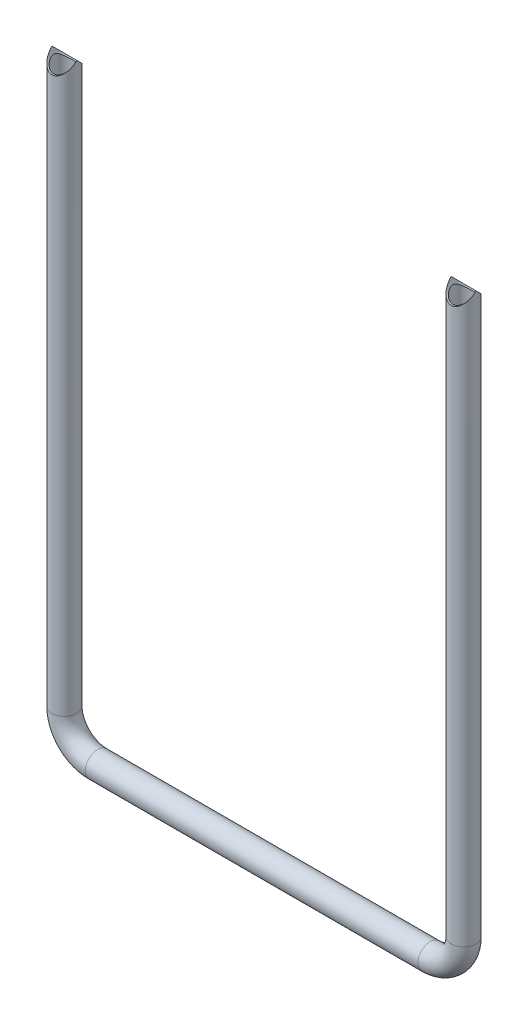
ISO-10303-21;
HEADER;
FILE_DESCRIPTION(('STEP AP214'),'2;1');
FILE_NAME('part.step','',(''),(''),'','','');
FILE_SCHEMA(('AUTOMOTIVE_DESIGN { 1 0 10303 214 1 1 1 1 }'));
ENDSEC;
DATA;
#1=APPLICATION_CONTEXT('core data for automotive mechanical design processes');
#2=APPLICATION_PROTOCOL_DEFINITION('international standard','automotive_design',2000,#1);
#3=PRODUCT_CONTEXT('',#1,'mechanical');
#4=PRODUCT('Part','Part','',(#3));
#5=PRODUCT_RELATED_PRODUCT_CATEGORY('part','',(#4));
#6=PRODUCT_DEFINITION_FORMATION('','',#4);
#7=PRODUCT_DEFINITION_CONTEXT('part definition',#1,'design');
#8=PRODUCT_DEFINITION('design','',#6,#7);
#9=PRODUCT_DEFINITION_SHAPE('','',#8);
#10=(LENGTH_UNIT() NAMED_UNIT(*) SI_UNIT(.MILLI.,.METRE.));
#11=(NAMED_UNIT(*) PLANE_ANGLE_UNIT() SI_UNIT($,.RADIAN.));
#12=(NAMED_UNIT(*) SI_UNIT($,.STERADIAN.) SOLID_ANGLE_UNIT());
#13=UNCERTAINTY_MEASURE_WITH_UNIT(LENGTH_MEASURE(1.E-05),#10,'distance_accuracy_value','');
#14=(GEOMETRIC_REPRESENTATION_CONTEXT(3) GLOBAL_UNCERTAINTY_ASSIGNED_CONTEXT((#13)) GLOBAL_UNIT_ASSIGNED_CONTEXT((#10,
#11,#12)) REPRESENTATION_CONTEXT('',''));
#15=CARTESIAN_POINT('',(0.,0.,0.));
#16=DIRECTION('',(0.,0.,1.));
#17=DIRECTION('',(1.,0.,0.));
#18=AXIS2_PLACEMENT_3D('',#15,#16,#17);
#19=CARTESIAN_POINT('',(-152.4,228.6,0.));
#20=DIRECTION('',(0.,-1.,0.));
#21=DIRECTION('',(0.,0.,-1.));
#22=AXIS2_PLACEMENT_3D('',#19,#20,#21);
#23=CYLINDRICAL_SURFACE('',#22,9.52500000000001);
#24=CARTESIAN_POINT('',(-152.4,-203.2,0.));
#25=DIRECTION('',(0.,1.,0.));
#26=DIRECTION('',(0.,0.,-1.));
#27=AXIS2_PLACEMENT_3D('',#24,#25,#26);
#28=CIRCLE('',#27,9.52500000000001);
#29=CARTESIAN_POINT('',(-161.925,-203.2,0.));
#30=VERTEX_POINT('',#29);
#31=EDGE_CURVE('E73',#30,#30,#28,.T.);
#32=ORIENTED_EDGE('',*,*,#31,.T.);
#33=EDGE_LOOP('',(#32));
#34=FACE_BOUND('',#33,.T.);
#35=CARTESIAN_POINT('',(-152.4,228.6,0.));
#36=DIRECTION('',(0.,-0.707106781186547,-0.707106781186547));
#37=DIRECTION('',(0.,-0.707106781186547,0.707106781186547));
#38=AXIS2_PLACEMENT_3D('',#35,#36,#37);
#39=ELLIPSE('',#38,13.4703841816037,9.525);
#40=CARTESIAN_POINT('',(-142.875,228.6,0.));
#41=VERTEX_POINT('',#40);
#42=CARTESIAN_POINT('',(-161.925,228.6,0.));
#43=VERTEX_POINT('',#42);
#44=EDGE_CURVE('E41',#41,#43,#39,.T.);
#45=ORIENTED_EDGE('',*,*,#44,.T.);
#46=CARTESIAN_POINT('',(-152.4,228.6,0.));
#47=DIRECTION('',(0.,-0.707106781186547,0.707106781186547));
#48=DIRECTION('',(0.,-0.707106781186547,-0.707106781186547));
#49=AXIS2_PLACEMENT_3D('',#46,#47,#48);
#50=ELLIPSE('',#49,13.4703841816037,9.525);
#51=EDGE_CURVE('E11',#43,#41,#50,.T.);
#52=ORIENTED_EDGE('',*,*,#51,.T.);
#53=EDGE_LOOP('',(#45,#52));
#54=FACE_BOUND('',#53,.T.);
#55=ADVANCED_FACE('F33',(#34,#54),#23,.T.);
#56=CARTESIAN_POINT('',(-127.,-203.2,0.));
#57=DIRECTION('',(0.,0.,1.));
#58=DIRECTION('',(1.,0.,0.));
#59=AXIS2_PLACEMENT_3D('',#56,#57,#58);
#60=TOROIDAL_SURFACE('',#59,25.4,9.52500000000001);
#61=CARTESIAN_POINT('',(-127.,-228.6,0.));
#62=DIRECTION('',(-1.,0.,0.));
#63=DIRECTION('',(0.,0.,-1.));
#64=AXIS2_PLACEMENT_3D('',#61,#62,#63);
#65=CIRCLE('',#64,9.52500000000001);
#66=CARTESIAN_POINT('',(-127.,-238.125,0.));
#67=VERTEX_POINT('',#66);
#68=EDGE_CURVE('E70',#67,#67,#65,.T.);
#69=CARTESIAN_POINT('',(-127.,-203.2,0.));
#70=DIRECTION('',(0.,0.,1.));
#71=DIRECTION('',(1.,0.,0.));
#72=AXIS2_PLACEMENT_3D('',#69,#70,#71);
#73=CIRCLE('',#72,34.925);
#74=EDGE_CURVE('',#30,#67,#73,.T.);
#75=ORIENTED_EDGE('',*,*,#31,.F.);
#76=ORIENTED_EDGE('',*,*,#68,.T.);
#77=ORIENTED_EDGE('',*,*,#74,.T.);
#78=ORIENTED_EDGE('',*,*,#74,.F.);
#79=EDGE_LOOP('',(#75,#77,#76,#78));
#80=FACE_BOUND('',#79,.T.);
#81=ADVANCED_FACE('F126',(#80),#60,.T.);
#82=CARTESIAN_POINT('',(-127.,-228.6,0.));
#83=DIRECTION('',(1.,0.,0.));
#84=DIRECTION('',(0.,0.,-1.));
#85=AXIS2_PLACEMENT_3D('',#82,#83,#84);
#86=CYLINDRICAL_SURFACE('',#85,9.52500000000001);
#87=CARTESIAN_POINT('',(127.,-228.6,0.));
#88=DIRECTION('',(-1.,0.,0.));
#89=DIRECTION('',(0.,0.,-1.));
#90=AXIS2_PLACEMENT_3D('',#87,#88,#89);
#91=CIRCLE('',#90,9.52500000000001);
#92=CARTESIAN_POINT('',(127.,-238.125,0.));
#93=VERTEX_POINT('',#92);
#94=EDGE_CURVE('E67',#93,#93,#91,.T.);
#95=ORIENTED_EDGE('',*,*,#94,.T.);
#96=EDGE_LOOP('',(#95));
#97=FACE_BOUND('',#96,.T.);
#98=ORIENTED_EDGE('',*,*,#68,.F.);
#99=EDGE_LOOP('',(#98));
#100=FACE_BOUND('',#99,.T.);
#101=ADVANCED_FACE('F121',(#97,#100),#86,.T.);
#102=CARTESIAN_POINT('',(127.,-203.2,0.));
#103=DIRECTION('',(0.,0.,1.));
#104=DIRECTION('',(1.,0.,0.));
#105=AXIS2_PLACEMENT_3D('',#102,#103,#104);
#106=TOROIDAL_SURFACE('',#105,25.4,9.52500000000001);
#107=CARTESIAN_POINT('',(152.4,-203.2,0.));
#108=DIRECTION('',(0.,-1.,0.));
#109=DIRECTION('',(0.,0.,-1.));
#110=AXIS2_PLACEMENT_3D('',#107,#108,#109);
#111=CIRCLE('',#110,9.52500000000001);
#112=CARTESIAN_POINT('',(161.925,-203.2,0.));
#113=VERTEX_POINT('',#112);
#114=EDGE_CURVE('E60',#113,#113,#111,.T.);
#115=CARTESIAN_POINT('',(127.,-203.2,0.));
#116=DIRECTION('',(0.,0.,1.));
#117=DIRECTION('',(1.,0.,0.));
#118=AXIS2_PLACEMENT_3D('',#115,#116,#117);
#119=CIRCLE('',#118,34.925);
#120=EDGE_CURVE('',#93,#113,#119,.T.);
#121=ORIENTED_EDGE('',*,*,#94,.F.);
#122=ORIENTED_EDGE('',*,*,#114,.T.);
#123=ORIENTED_EDGE('',*,*,#120,.T.);
#124=ORIENTED_EDGE('',*,*,#120,.F.);
#125=EDGE_LOOP('',(#121,#123,#122,#124));
#126=FACE_BOUND('',#125,.T.);
#127=ADVANCED_FACE('F114',(#126),#106,.T.);
#128=CARTESIAN_POINT('',(152.4,-203.2,0.));
#129=DIRECTION('',(0.,1.,0.));
#130=DIRECTION('',(0.,0.,1.));
#131=AXIS2_PLACEMENT_3D('',#128,#129,#130);
#132=CYLINDRICAL_SURFACE('',#131,9.52500000000001);
#133=CARTESIAN_POINT('',(152.4,228.6,0.));
#134=DIRECTION('',(0.,0.707106781186547,-0.707106781186547));
#135=DIRECTION('',(0.,0.707106781186547,0.707106781186547));
#136=AXIS2_PLACEMENT_3D('',#133,#134,#135);
#137=ELLIPSE('',#136,13.4703841816037,9.525);
#138=CARTESIAN_POINT('',(142.875,228.6,0.));
#139=VERTEX_POINT('',#138);
#140=CARTESIAN_POINT('',(161.925,228.6,0.));
#141=VERTEX_POINT('',#140);
#142=EDGE_CURVE('E57',#139,#141,#137,.F.);
#143=ORIENTED_EDGE('',*,*,#142,.T.);
#144=CARTESIAN_POINT('',(152.4,228.6,0.));
#145=DIRECTION('',(0.,0.707106781186547,0.707106781186547));
#146=DIRECTION('',(0.,0.707106781186547,-0.707106781186547));
#147=AXIS2_PLACEMENT_3D('',#144,#145,#146);
#148=ELLIPSE('',#147,13.4703841816037,9.525);
#149=EDGE_CURVE('E52',#141,#139,#148,.F.);
#150=ORIENTED_EDGE('',*,*,#149,.T.);
#151=EDGE_LOOP('',(#143,#150));
#152=FACE_BOUND('',#151,.T.);
#153=ORIENTED_EDGE('',*,*,#114,.F.);
#154=EDGE_LOOP('',(#153));
#155=FACE_BOUND('',#154,.T.);
#156=ADVANCED_FACE('F35',(#152,#155),#132,.T.);
#157=CARTESIAN_POINT('',(152.4,228.6,-238.125));
#158=DIRECTION('',(0.,0.,1.));
#159=DIRECTION('',(1.,0.,0.));
#160=AXIS2_PLACEMENT_3D('',#157,#158,#159);
#161=CYLINDRICAL_SURFACE('',#160,9.52499999999999);
#162=CARTESIAN_POINT('',(152.4,219.075,-8.25500000000001));
#163=CARTESIAN_POINT('',(152.593749133983,219.075000851371,-8.25499913097361));
#164=CARTESIAN_POINT('',(152.787510695369,219.080923976125,-8.24816678082067));
#165=CARTESIAN_POINT('',(153.173368577547,219.104480069302,-8.22096978778912));
#166=CARTESIAN_POINT('',(153.365464750048,219.122114069863,-8.20060395213658));
#167=CARTESIAN_POINT('',(153.746505754108,219.168700531082,-8.14671669800962));
#168=CARTESIAN_POINT('',(153.935448859172,219.197658993398,-8.11318830370018));
#169=CARTESIAN_POINT('',(154.308674190852,219.26626573945,-8.03357968300137));
#170=CARTESIAN_POINT('',(154.492956414168,219.305914030754,-7.98749944772571));
#171=CARTESIAN_POINT('',(154.854517254249,219.394816129542,-7.88387682013201));
#172=CARTESIAN_POINT('',(155.031833318214,219.444006461934,-7.82641012090954));
#173=CARTESIAN_POINT('',(155.379870442183,219.551288626491,-7.70062697305925));
#174=CARTESIAN_POINT('',(155.55058857676,219.609384351749,-7.63230577878791));
#175=CARTESIAN_POINT('',(155.884651882336,219.733513866231,-7.48568628536984));
#176=CARTESIAN_POINT('',(156.047997851083,219.799546793716,-7.40738906925856));
#177=CARTESIAN_POINT('',(156.366887574014,219.938608516535,-7.24162523096908));
#178=CARTESIAN_POINT('',(156.522429608553,220.011638843562,-7.15415660082004));
#179=CARTESIAN_POINT('',(156.883524955091,220.192942230831,-6.93563606350436));
#180=CARTESIAN_POINT('',(157.085372428281,220.303987372303,-6.80073731523926));
#181=CARTESIAN_POINT('',(157.473118621409,220.535256151997,-6.51661799509544));
#182=CARTESIAN_POINT('',(157.659011633082,220.655483046478,-6.36739233738684));
#183=CARTESIAN_POINT('',(158.015142976407,220.903057246967,-6.05568545559864));
#184=CARTESIAN_POINT('',(158.185343327033,221.03042068778,-5.89317377902941));
#185=CARTESIAN_POINT('',(158.509650125725,221.289672364822,-5.55624676339451));
#186=CARTESIAN_POINT('',(158.663758711384,221.421559996968,-5.38183301047557));
#187=CARTESIAN_POINT('',(158.959109417956,221.690268739031,-5.0178870415543));
#188=CARTESIAN_POINT('',(159.100013389537,221.827135289796,-4.82811425764209));
#189=CARTESIAN_POINT('',(159.365304618899,222.100277029826,-4.4368295491694));
#190=CARTESIAN_POINT('',(159.489686522828,222.23655201363,-4.23531384968984));
#191=CARTESIAN_POINT('',(159.721483300549,222.504688635106,-3.82063329870357));
#192=CARTESIAN_POINT('',(159.828932333052,222.636558723786,-3.60749309828618));
#193=CARTESIAN_POINT('',(160.026529850752,222.891442369474,-3.16843181970335));
#194=CARTESIAN_POINT('',(160.116692012068,223.01446287908,-2.9425210294585));
#195=CARTESIAN_POINT('',(160.282003581481,223.250125579428,-2.46681442998318));
#196=CARTESIAN_POINT('',(160.356366663297,223.362117857019,-2.21641466916662));
#197=CARTESIAN_POINT('',(160.482480743163,223.558880568049,-1.69963891728646));
#198=CARTESIAN_POINT('',(160.534280059203,223.643709065653,-1.43329846759251));
#199=CARTESIAN_POINT('',(160.589573262637,223.736097566616,-1.04394084534309));
#200=CARTESIAN_POINT('',(160.603739392844,223.760081572859,-0.926240140688877));
#201=CARTESIAN_POINT('',(160.627058784652,223.799826557136,-0.68899088744708));
#202=CARTESIAN_POINT('',(160.636214416545,223.815591423194,-0.56944324015398));
#203=CARTESIAN_POINT('',(160.649304199387,223.838195926769,-0.329320339337323));
#204=CARTESIAN_POINT('',(160.653242897697,223.845043337139,-0.208746073071936));
#205=CARTESIAN_POINT('',(160.655817780715,223.849515298126,0.0326338460709907));
#206=CARTESIAN_POINT('',(160.654453909342,223.847139751201,0.153439501382234));
#207=CARTESIAN_POINT('',(160.646462088077,223.833287188579,0.394165546022823));
#208=CARTESIAN_POINT('',(160.639842089721,223.821823920942,0.514086996622003));
#209=CARTESIAN_POINT('',(160.621507905245,223.790347526087,0.752426471254559));
#210=CARTESIAN_POINT('',(160.609791553356,223.770330763999,0.870843834060189));
#211=CARTESIAN_POINT('',(160.567308180379,223.698589799333,1.22310602414189));
#212=CARTESIAN_POINT('',(160.52921400914,223.635188530354,1.45376292887391));
#213=CARTESIAN_POINT('',(160.444099327065,223.498694955178,1.86370727584935));
#214=CARTESIAN_POINT('',(160.39983803945,223.429283916365,2.04487996617528));
#215=CARTESIAN_POINT('',(160.300705639612,223.279042683176,2.39953345699065));
#216=CARTESIAN_POINT('',(160.245827210796,223.198204624502,2.57300885110589));
#217=CARTESIAN_POINT('',(160.12605718343,223.028240047895,2.91302040075865));
#218=CARTESIAN_POINT('',(160.061131514579,222.939085754094,3.07953040069089));
#219=CARTESIAN_POINT('',(159.921927466596,222.755384272125,3.40543837179347));
#220=CARTESIAN_POINT('',(159.847650146436,222.660837695236,3.56483714546791));
#221=CARTESIAN_POINT('',(159.648366005193,222.417533604388,3.95950975045322));
#222=CARTESIAN_POINT('',(159.517295478695,222.266534072351,4.19036061822685));
#223=CARTESIAN_POINT('',(159.234385836415,221.962225101465,4.63747538270598));
#224=CARTESIAN_POINT('',(159.082536348192,221.808914543225,4.85373191319793));
#225=CARTESIAN_POINT('',(158.758297438884,221.504431641632,5.27132385376011));
#226=CARTESIAN_POINT('',(158.585934138232,221.353256847606,5.47267772045495));
#227=CARTESIAN_POINT('',(158.220393868889,221.056523823392,5.85993838639324));
#228=CARTESIAN_POINT('',(158.027226231587,220.910963114576,6.04585204532017));
#229=CARTESIAN_POINT('',(157.66880872899,220.662698797748,6.35820893639361));
#230=CARTESIAN_POINT('',(157.507976401375,220.558090176679,6.4882204173457));
#231=CARTESIAN_POINT('',(157.174263989522,220.355601927927,6.73756594349469));
#232=CARTESIAN_POINT('',(157.001386560908,220.257720826399,6.85690232909825));
#233=CARTESIAN_POINT('',(156.643997602673,220.070359334607,7.0836600365112));
#234=CARTESIAN_POINT('',(156.459500473618,219.980868875253,7.19109566852852));
#235=CARTESIAN_POINT('',(156.079162252312,219.81178786899,7.39290924178349));
#236=CARTESIAN_POINT('',(155.883323285382,219.732195476047,7.48728961825415));
#237=CARTESIAN_POINT('',(155.516896785423,219.597688658435,7.64607452720221));
#238=CARTESIAN_POINT('',(155.348010254905,219.540902606584,7.7128251587236));
#239=CARTESIAN_POINT('',(155.003811346086,219.436041203049,7.83572387058535));
#240=CARTESIAN_POINT('',(154.828500319075,219.387964032091,7.89187416542451));
#241=CARTESIAN_POINT('',(154.472375751217,219.30137378059,7.99277926561641));
#242=CARTESIAN_POINT('',(154.291564121593,219.262857419736,8.03753797954925));
#243=CARTESIAN_POINT('',(153.925491254042,219.19611185728,8.11497986008865));
#244=CARTESIAN_POINT('',(153.740229967554,219.167882768005,8.14766289484147));
#245=CARTESIAN_POINT('',(153.365693777288,219.122193476377,8.20051181828127));
#246=CARTESIAN_POINT('',(153.176403964305,219.104785183164,8.22061737363727));
#247=CARTESIAN_POINT('',(152.79618049332,219.081337103709,8.24768993736897));
#248=CARTESIAN_POINT('',(152.605246831616,219.075297343066,8.25465691616096));
#249=CARTESIAN_POINT('',(152.223354685229,219.07472412799,8.25531830954021));
#250=CARTESIAN_POINT('',(152.032396203547,219.080189796571,8.24901373573472));
#251=CARTESIAN_POINT('',(151.652047815249,219.102501380858,8.22325492565545));
#252=CARTESIAN_POINT('',(151.462657842174,219.11934681187,8.20380124943698));
#253=CARTESIAN_POINT('',(151.101276987326,219.162336192805,8.15408122776019));
#254=CARTESIAN_POINT('',(150.929059372116,219.187674409474,8.12475103759837));
#255=CARTESIAN_POINT('',(150.588261428203,219.247291157423,8.05561104968292));
#256=CARTESIAN_POINT('',(150.419682335142,219.28157267569,8.01579775061751));
#257=CARTESIAN_POINT('',(150.087193793368,219.358481542436,7.92625943872893));
#258=CARTESIAN_POINT('',(149.923282977198,219.401106417521,7.87653736329023));
#259=CARTESIAN_POINT('',(149.600772493091,219.494060632431,7.76777500026872));
#260=CARTESIAN_POINT('',(149.442174832152,219.544392844517,7.7087312385565));
#261=CARTESIAN_POINT('',(149.118760887249,219.656253247045,7.57702515132393));
#262=CARTESIAN_POINT('',(148.954427355193,219.718349023612,7.50365911320597));
#263=CARTESIAN_POINT('',(148.633184711284,219.84974919785,7.34765599089065));
#264=CARTESIAN_POINT('',(148.476278556494,219.919056432078,7.26501525757015));
#265=CARTESIAN_POINT('',(148.017216319907,220.136469748638,7.00428589271635));
#266=CARTESIAN_POINT('',(147.726665178198,220.294085643406,6.81336884998675));
#267=CARTESIAN_POINT('',(147.245068693598,220.586795384044,6.45283278047183));
#268=CARTESIAN_POINT('',(147.04698711938,220.718072006197,6.28928934942977));
#269=CARTESIAN_POINT('',(146.669526138686,220.988096265142,5.94739409173004));
#270=CARTESIAN_POINT('',(146.490147928305,221.126844378882,5.76904131931234));
#271=CARTESIAN_POINT('',(146.149627109202,221.409205633139,5.39827838667592));
#272=CARTESIAN_POINT('',(145.988530218004,221.552829852161,5.20583488153902));
#273=CARTESIAN_POINT('',(145.684949827782,221.841483857342,4.80788440247815));
#274=CARTESIAN_POINT('',(145.542460637592,221.986513199098,4.60238145150825));
#275=CARTESIAN_POINT('',(145.303388496548,222.244840743108,4.22170022153732));
#276=CARTESIAN_POINT('',(145.203382572897,222.358549640076,4.0489403447749));
#277=CARTESIAN_POINT('',(145.015258160118,222.582312464771,3.6947062081715));
#278=CARTESIAN_POINT('',(144.927141855052,222.692365718185,3.51323035552953));
#279=CARTESIAN_POINT('',(144.763421066369,222.905590868977,3.14146809775945));
#280=CARTESIAN_POINT('',(144.687785187886,223.00877963104,2.95120539019992));
#281=CARTESIAN_POINT('',(144.549545792574,223.204599732918,2.56091153040395));
#282=CARTESIAN_POINT('',(144.486933073675,223.297238506192,2.36088739974971));
#283=CARTESIAN_POINT('',(144.366906121685,223.480539028389,1.91710109618573));
#284=CARTESIAN_POINT('',(144.311947549068,223.568486554437,1.67147843973419));
#285=CARTESIAN_POINT('',(144.245995162006,223.676624086336,1.29366079541498));
#286=CARTESIAN_POINT('',(144.226766608547,223.708691291353,1.16625357807997));
#287=CARTESIAN_POINT('',(144.194148700816,223.76361192475,0.908760812182226));
#288=CARTESIAN_POINT('',(144.180756207151,223.786470306333,0.778676743118127));
#289=CARTESIAN_POINT('',(144.160010368661,223.82206810894,0.515053294316012));
#290=CARTESIAN_POINT('',(144.15273047777,223.834684394664,0.381491235325685));
#291=CARTESIAN_POINT('',(144.144693892553,223.848619874186,0.113582080058742));
#292=CARTESIAN_POINT('',(144.14393671112,223.849939911573,-0.0207649568470142));
#293=CARTESIAN_POINT('',(144.148970145876,223.841202324924,-0.289034938598465));
#294=CARTESIAN_POINT('',(144.154764441386,223.831138307579,-0.422957602740163));
#295=CARTESIAN_POINT('',(144.172731137426,223.800209848149,-0.68911168374213));
#296=CARTESIAN_POINT('',(144.184904590814,223.779343623203,-0.821342817729412));
#297=CARTESIAN_POINT('',(144.217793404478,223.723697580562,-1.10454643006354));
#298=CARTESIAN_POINT('',(144.239578635414,223.687202723969,-1.25505528789717));
#299=CARTESIAN_POINT('',(144.290749992828,223.603191155665,-1.55170325268703));
#300=CARTESIAN_POINT('',(144.320142303591,223.555665479551,-1.69783869586882));
#301=CARTESIAN_POINT('',(144.386021121705,223.451644772577,-1.98570912314552));
#302=CARTESIAN_POINT('',(144.422528578341,223.39512334772,-2.12742964309163));
#303=CARTESIAN_POINT('',(144.502066057463,223.275204077361,-2.40595811079107));
#304=CARTESIAN_POINT('',(144.545094614622,223.211807777588,-2.54276715365898));
#305=CARTESIAN_POINT('',(144.670168950102,223.032749866028,-2.90759118568053));
#306=CARTESIAN_POINT('',(144.758163433105,222.912045295214,-3.13110425848442));
#307=CARTESIAN_POINT('',(144.950968983281,222.661768069578,-3.56559758605922));
#308=CARTESIAN_POINT('',(145.055791579878,222.532189369989,-3.77656911147844));
#309=CARTESIAN_POINT('',(145.281824189893,222.268538777804,-4.18706965610035));
#310=CARTESIAN_POINT('',(145.403056880467,222.134460864055,-4.38658228697997));
#311=CARTESIAN_POINT('',(145.661578509005,221.865453567415,-4.77419601105201));
#312=CARTESIAN_POINT('',(145.798863498402,221.730524401609,-4.96229989336761));
#313=CARTESIAN_POINT('',(146.098444095809,221.454370347392,-5.3382258744761));
#314=CARTESIAN_POINT('',(146.261755311956,221.313264475866,-5.52532860119195));
#315=CARTESIAN_POINT('',(146.606719513531,221.036105671408,-5.88601693765019));
#316=CARTESIAN_POINT('',(146.788376069838,220.90005372929,-6.05959990411032));
#317=CARTESIAN_POINT('',(147.169682424321,220.636140711227,-6.39160103031022));
#318=CARTESIAN_POINT('',(147.369291566071,220.50826219629,-6.55005185964249));
#319=CARTESIAN_POINT('',(147.78667872514,220.263250623787,-6.85042540907246));
#320=CARTESIAN_POINT('',(148.004448356632,220.146112658529,-6.99235568599344));
#321=CARTESIAN_POINT('',(148.391711433497,219.957591966555,-7.21895608703125));
#322=CARTESIAN_POINT('',(148.556843154747,219.882805017897,-7.30828007272977));
#323=CARTESIAN_POINT('',(148.895556720758,219.74120930788,-7.47660654907035));
#324=CARTESIAN_POINT('',(149.069136470562,219.674398582611,-7.55561158090455));
#325=CARTESIAN_POINT('',(149.423998853516,219.549896757306,-7.70228991439693));
#326=CARTESIAN_POINT('',(149.605274584102,219.492197695421,-7.76997311226875));
#327=CARTESIAN_POINT('',(149.974795693031,219.386917126928,-7.89311833522139));
#328=CARTESIAN_POINT('',(150.163040304597,219.339334511082,-7.94858170019485));
#329=CARTESIAN_POINT('',(150.518653766488,219.261127906438,-8.039551741935));
#330=CARTESIAN_POINT('',(150.685271665007,219.229064178173,-8.07676302214278));
#331=CARTESIAN_POINT('',(151.021958753979,219.173668033218,-8.14097036810244));
#332=CARTESIAN_POINT('',(151.192028895362,219.150338057636,-8.16796357789892));
#333=CARTESIAN_POINT('',(151.534511854833,219.112838905102,-8.21131805296772));
#334=CARTESIAN_POINT('',(151.706924486121,219.09866900201,-8.22768016098988));
#335=CARTESIAN_POINT('',(152.052888376113,219.079750865947,-8.24951956226247));
#336=CARTESIAN_POINT('',(152.226439201805,219.074999237341,-8.25500077847531));
#337=CARTESIAN_POINT('',(152.4,219.075,-8.25500000000001));
#338=B_SPLINE_CURVE_WITH_KNOTS('',3,(#162,#163,#164,#165,#166,#167,#168,#169,#170,#171,#172,
#173,#174,#175,#176,#177,#178,#179,#180,#181,#182,#183,#184,#185,#186,#187,#188,#189,#190,#191,
#192,#193,#194,#195,#196,#197,#198,#199,#200,#201,#202,#203,#204,#205,#206,#207,#208,#209,#210,
#211,#212,#213,#214,#215,#216,#217,#218,#219,#220,#221,#222,#223,#224,#225,#226,#227,#228,#229,
#230,#231,#232,#233,#234,#235,#236,#237,#238,#239,#240,#241,#242,#243,#244,#245,#246,#247,#248,
#249,#250,#251,#252,#253,#254,#255,#256,#257,#258,#259,#260,#261,#262,#263,#264,#265,#266,#267,
#268,#269,#270,#271,#272,#273,#274,#275,#276,#277,#278,#279,#280,#281,#282,#283,#284,#285,#286,
#287,#288,#289,#290,#291,#292,#293,#294,#295,#296,#297,#298,#299,#300,#301,#302,#303,#304,#305,
#306,#307,#308,#309,#310,#311,#312,#313,#314,#315,#316,#317,#318,#319,#320,#321,#322,#323,#324,
#325,#326,#327,#328,#329,#330,#331,#332,#333,#334,#335,#336,#337),.UNSPECIFIED.,.T.,.F.,(4,2,2,
2,2,2,2,2,2,2,2,2,2,2,2,2,2,2,2,2,2,2,2,2,2,2,2,2,2,2,2,2,2,2,2,2,2,2,2,2,2,2,2,2,2,2,2,2,2,2,2,
2,2,2,2,2,2,2,2,2,2,2,2,2,2,2,2,2,2,2,2,2,2,2,2,2,2,2,2,2,2,2,2,2,2,2,2,4),(0.,
0.581060302241147,1.16217182303358,1.74359173542288,2.32501205943971,2.90268969124198,
3.48062058537872,4.05848879048122,4.63648377810276,5.43621695420247,6.23623508026258,
7.03814127970883,7.83994081992863,8.65857780584576,9.47747942119566,10.2947073130675,
11.1112859813718,11.9620431912297,12.8109695269324,13.1734956172863,13.5358500604876,
13.8978884475343,14.2599306635728,14.6214262186982,14.9830755469357,15.7069631447091,
16.3031815010825,16.8998122025499,17.4985123074859,18.0971446771323,19.0121600805803,
19.9276339189251,20.8419543021521,21.7558662790184,22.4505614625091,23.1451039659047,
23.8388020282264,24.5323705181272,25.102627506706,25.6727652316906,26.2427070714557,
26.8126551342036,27.3853166471829,27.9579794496038,28.5305986031097,29.1031933687764,
29.6321866176357,30.1613567724987,30.6903702914558,31.2195814376325,31.7901536941554,
32.360951234249,33.5023725912858,34.3667872613036,35.2312571774337,36.0978433977629,
36.9641639487798,37.6529096955541,38.3417817896671,39.0288936791848,39.715518398605,
40.512573766315,40.9105237639805,41.3082594272077,41.7107088469781,42.1131282121322,
42.5157736890733,42.918485642225,43.38692566356,43.8557477127696,44.3259715675199,
44.7960899166667,45.6013224389748,46.4071090223581,47.2140207141777,48.020734336611,
48.8767355197429,49.732903643882,50.5871794481831,51.4410629415441,52.0468024868874,
52.6523925776822,53.2574505352097,53.8624421156741,54.3830405578493,54.9037844002805,
55.4244869572119,55.9450017475654),.UNSPECIFIED.);
#339=CARTESIAN_POINT('',(152.4,219.075,-8.25500000000001));
#340=VERTEX_POINT('',#339);
#341=EDGE_CURVE('E77',#340,#340,#338,.T.);
#342=ORIENTED_EDGE('',*,*,#341,.T.);
#343=EDGE_LOOP('',(#342));
#344=FACE_BOUND('',#343,.T.);
#345=ORIENTED_EDGE('',*,*,#142,.F.);
#346=ORIENTED_EDGE('',*,*,#149,.F.);
#347=EDGE_LOOP('',(#345,#346));
#348=FACE_BOUND('',#347,.T.);
#349=ADVANCED_FACE('F58',(#344,#348),#161,.F.);
#350=CARTESIAN_POINT('',(-152.4,228.6,-238.125));
#351=DIRECTION('',(0.,0.,1.));
#352=DIRECTION('',(1.,0.,0.));
#353=AXIS2_PLACEMENT_3D('',#350,#351,#352);
#354=CYLINDRICAL_SURFACE('',#353,9.52499999999999);
#355=CARTESIAN_POINT('',(-152.4,219.075,8.25500000000001));
#356=CARTESIAN_POINT('',(-152.593749133983,219.075000851371,8.25499913097361));
#357=CARTESIAN_POINT('',(-152.787510695368,219.080923976125,8.24816678082067));
#358=CARTESIAN_POINT('',(-153.173368577547,219.104480069302,8.22096978778912));
#359=CARTESIAN_POINT('',(-153.365464750048,219.122114069863,8.20060395213658));
#360=CARTESIAN_POINT('',(-153.746505754108,219.168700531082,8.14671669800962));
#361=CARTESIAN_POINT('',(-153.935448859172,219.197658993398,8.11318830370018));
#362=CARTESIAN_POINT('',(-154.308674190852,219.26626573945,8.03357968300137));
#363=CARTESIAN_POINT('',(-154.492956414168,219.305914030754,7.98749944772571));
#364=CARTESIAN_POINT('',(-154.854517254249,219.394816129542,7.88387682013201));
#365=CARTESIAN_POINT('',(-155.031833318214,219.444006461934,7.82641012090954));
#366=CARTESIAN_POINT('',(-155.379870442183,219.551288626491,7.70062697305925));
#367=CARTESIAN_POINT('',(-155.55058857676,219.609384351749,7.63230577878791));
#368=CARTESIAN_POINT('',(-155.884651882336,219.733513866231,7.48568628536984));
#369=CARTESIAN_POINT('',(-156.047997851083,219.799546793716,7.40738906925856));
#370=CARTESIAN_POINT('',(-156.366887574014,219.938608516535,7.24162523096908));
#371=CARTESIAN_POINT('',(-156.522429608553,220.011638843562,7.15415660082004));
#372=CARTESIAN_POINT('',(-156.883524955091,220.192942230831,6.93563606350436));
#373=CARTESIAN_POINT('',(-157.08537242828,220.303987372303,6.80073731523926));
#374=CARTESIAN_POINT('',(-157.473118621409,220.535256151997,6.51661799509544));
#375=CARTESIAN_POINT('',(-157.659011633082,220.655483046478,6.36739233738684));
#376=CARTESIAN_POINT('',(-158.015142976407,220.903057246967,6.05568545559864));
#377=CARTESIAN_POINT('',(-158.185343327033,221.03042068778,5.89317377902941));
#378=CARTESIAN_POINT('',(-158.509650125725,221.289672364822,5.55624676339451));
#379=CARTESIAN_POINT('',(-158.663758711384,221.421559996968,5.38183301047557));
#380=CARTESIAN_POINT('',(-158.959109417956,221.690268739031,5.0178870415543));
#381=CARTESIAN_POINT('',(-159.100013389536,221.827135289796,4.82811425764209));
#382=CARTESIAN_POINT('',(-159.365304618899,222.100277029826,4.4368295491694));
#383=CARTESIAN_POINT('',(-159.489686522828,222.23655201363,4.23531384968984));
#384=CARTESIAN_POINT('',(-159.721483300549,222.504688635106,3.82063329870357));
#385=CARTESIAN_POINT('',(-159.828932333052,222.636558723786,3.60749309828618));
#386=CARTESIAN_POINT('',(-160.026529850752,222.891442369474,3.16843181970335));
#387=CARTESIAN_POINT('',(-160.116692012068,223.01446287908,2.9425210294585));
#388=CARTESIAN_POINT('',(-160.282003581481,223.250125579428,2.46681442998318));
#389=CARTESIAN_POINT('',(-160.356366663297,223.362117857019,2.21641466916662));
#390=CARTESIAN_POINT('',(-160.482480743163,223.558880568049,1.69963891728646));
#391=CARTESIAN_POINT('',(-160.534280059203,223.643709065653,1.43329846759251));
#392=CARTESIAN_POINT('',(-160.589573262637,223.736097566616,1.04394084534309));
#393=CARTESIAN_POINT('',(-160.603739392844,223.760081572859,0.926240140688877));
#394=CARTESIAN_POINT('',(-160.627058784652,223.799826557136,0.68899088744708));
#395=CARTESIAN_POINT('',(-160.636214416545,223.815591423194,0.56944324015398));
#396=CARTESIAN_POINT('',(-160.649304199387,223.838195926769,0.329320339337323));
#397=CARTESIAN_POINT('',(-160.653242897697,223.845043337139,0.208746073071936));
#398=CARTESIAN_POINT('',(-160.655817780715,223.849515298126,-0.0326338460709907));
#399=CARTESIAN_POINT('',(-160.654453909342,223.847139751201,-0.153439501382234));
#400=CARTESIAN_POINT('',(-160.646462088077,223.833287188579,-0.394165546022823));
#401=CARTESIAN_POINT('',(-160.639842089721,223.821823920942,-0.514086996622002));
#402=CARTESIAN_POINT('',(-160.621507905245,223.790347526087,-0.752426471254559));
#403=CARTESIAN_POINT('',(-160.609791553356,223.770330763999,-0.870843834060189));
#404=CARTESIAN_POINT('',(-160.567308180379,223.698589799333,-1.22310602414189));
#405=CARTESIAN_POINT('',(-160.52921400914,223.635188530354,-1.45376292887392));
#406=CARTESIAN_POINT('',(-160.444099327065,223.498694955178,-1.86370727584935));
#407=CARTESIAN_POINT('',(-160.39983803945,223.429283916365,-2.04487996617529));
#408=CARTESIAN_POINT('',(-160.300705639612,223.279042683176,-2.39953345699067));
#409=CARTESIAN_POINT('',(-160.245827210796,223.198204624502,-2.5730088511059));
#410=CARTESIAN_POINT('',(-160.12605718343,223.028240047895,-2.91302040075866));
#411=CARTESIAN_POINT('',(-160.061131514579,222.939085754094,-3.0795304006909));
#412=CARTESIAN_POINT('',(-159.921927466596,222.755384272125,-3.40543837179347));
#413=CARTESIAN_POINT('',(-159.847650146436,222.660837695236,-3.56483714546791));
#414=CARTESIAN_POINT('',(-159.648366005193,222.417533604388,-3.95950975045323));
#415=CARTESIAN_POINT('',(-159.517295478695,222.266534072351,-4.19036061822688));
#416=CARTESIAN_POINT('',(-159.234385836415,221.962225101465,-4.637475382706));
#417=CARTESIAN_POINT('',(-159.082536348192,221.808914543225,-4.85373191319794));
#418=CARTESIAN_POINT('',(-158.758297438884,221.504431641632,-5.27132385376012));
#419=CARTESIAN_POINT('',(-158.585934138232,221.353256847606,-5.47267772045495));
#420=CARTESIAN_POINT('',(-158.220393868889,221.056523823392,-5.85993838639324));
#421=CARTESIAN_POINT('',(-158.027226231587,220.910963114576,-6.04585204532017));
#422=CARTESIAN_POINT('',(-157.66880872899,220.662698797748,-6.35820893639361));
#423=CARTESIAN_POINT('',(-157.507976401375,220.558090176679,-6.4882204173457));
#424=CARTESIAN_POINT('',(-157.174263989522,220.355601927927,-6.73756594349468));
#425=CARTESIAN_POINT('',(-157.001386560908,220.257720826399,-6.85690232909824));
#426=CARTESIAN_POINT('',(-156.643997602673,220.070359334607,-7.08366003651119));
#427=CARTESIAN_POINT('',(-156.459500473618,219.980868875253,-7.19109566852851));
#428=CARTESIAN_POINT('',(-156.079162252312,219.81178786899,-7.39290924178348));
#429=CARTESIAN_POINT('',(-155.883323285382,219.732195476047,-7.48728961825415));
#430=CARTESIAN_POINT('',(-155.516896785423,219.597688658435,-7.64607452720221));
#431=CARTESIAN_POINT('',(-155.348010254905,219.540902606584,-7.7128251587236));
#432=CARTESIAN_POINT('',(-155.003811346086,219.436041203049,-7.83572387058536));
#433=CARTESIAN_POINT('',(-154.828500319075,219.387964032091,-7.89187416542451));
#434=CARTESIAN_POINT('',(-154.472375751217,219.30137378059,-7.99277926561641));
#435=CARTESIAN_POINT('',(-154.291564121593,219.262857419736,-8.03753797954925));
#436=CARTESIAN_POINT('',(-153.925491254042,219.19611185728,-8.11497986008865));
#437=CARTESIAN_POINT('',(-153.740229967553,219.167882768005,-8.14766289484147));
#438=CARTESIAN_POINT('',(-153.365693777288,219.122193476377,-8.20051181828127));
#439=CARTESIAN_POINT('',(-153.176403964305,219.104785183164,-8.22061737363727));
#440=CARTESIAN_POINT('',(-152.79618049332,219.081337103709,-8.24768993736897));
#441=CARTESIAN_POINT('',(-152.605246831616,219.075297343066,-8.25465691616096));
#442=CARTESIAN_POINT('',(-152.223354685229,219.07472412799,-8.25531830954021));
#443=CARTESIAN_POINT('',(-152.032396203547,219.080189796571,-8.24901373573472));
#444=CARTESIAN_POINT('',(-151.652047815249,219.102501380858,-8.22325492565545));
#445=CARTESIAN_POINT('',(-151.462657842174,219.11934681187,-8.20380124943698));
#446=CARTESIAN_POINT('',(-151.101276987326,219.162336192805,-8.15408122776019));
#447=CARTESIAN_POINT('',(-150.929059372116,219.187674409474,-8.12475103759837));
#448=CARTESIAN_POINT('',(-150.588261428203,219.247291157423,-8.05561104968292));
#449=CARTESIAN_POINT('',(-150.419682335142,219.28157267569,-8.01579775061751));
#450=CARTESIAN_POINT('',(-150.087193793368,219.358481542436,-7.92625943872893));
#451=CARTESIAN_POINT('',(-149.923282977198,219.401106417521,-7.87653736329023));
#452=CARTESIAN_POINT('',(-149.600772493091,219.494060632431,-7.76777500026873));
#453=CARTESIAN_POINT('',(-149.442174832152,219.544392844517,-7.7087312385565));
#454=CARTESIAN_POINT('',(-149.118760887248,219.656253247045,-7.57702515132393));
#455=CARTESIAN_POINT('',(-148.954427355192,219.718349023612,-7.50365911320598));
#456=CARTESIAN_POINT('',(-148.633184711284,219.84974919785,-7.34765599089065));
#457=CARTESIAN_POINT('',(-148.476278556494,219.919056432078,-7.26501525757015));
#458=CARTESIAN_POINT('',(-148.017216319907,220.136469748638,-7.00428589271635));
#459=CARTESIAN_POINT('',(-147.726665178198,220.294085643406,-6.81336884998675));
#460=CARTESIAN_POINT('',(-147.245068693598,220.586795384044,-6.45283278047183));
#461=CARTESIAN_POINT('',(-147.04698711938,220.718072006197,-6.28928934942977));
#462=CARTESIAN_POINT('',(-146.669526138686,220.988096265142,-5.94739409173004));
#463=CARTESIAN_POINT('',(-146.490147928305,221.126844378882,-5.76904131931234));
#464=CARTESIAN_POINT('',(-146.149627109202,221.409205633139,-5.39827838667592));
#465=CARTESIAN_POINT('',(-145.988530218004,221.552829852161,-5.20583488153902));
#466=CARTESIAN_POINT('',(-145.684949827782,221.841483857342,-4.80788440247815));
#467=CARTESIAN_POINT('',(-145.542460637592,221.986513199098,-4.60238145150825));
#468=CARTESIAN_POINT('',(-145.303388496548,222.244840743108,-4.22170022153732));
#469=CARTESIAN_POINT('',(-145.203382572897,222.358549640076,-4.0489403447749));
#470=CARTESIAN_POINT('',(-145.015258160118,222.582312464771,-3.6947062081715));
#471=CARTESIAN_POINT('',(-144.927141855052,222.692365718185,-3.51323035552953));
#472=CARTESIAN_POINT('',(-144.763421066369,222.905590868977,-3.14146809775945));
#473=CARTESIAN_POINT('',(-144.687785187886,223.00877963104,-2.95120539019992));
#474=CARTESIAN_POINT('',(-144.549545792574,223.204599732918,-2.56091153040394));
#475=CARTESIAN_POINT('',(-144.486933073675,223.297238506192,-2.36088739974971));
#476=CARTESIAN_POINT('',(-144.366906121685,223.480539028389,-1.91710109618573));
#477=CARTESIAN_POINT('',(-144.311947549068,223.568486554437,-1.67147843973419));
#478=CARTESIAN_POINT('',(-144.245995162006,223.676624086336,-1.29366079541498));
#479=CARTESIAN_POINT('',(-144.226766608547,223.708691291353,-1.16625357807997));
#480=CARTESIAN_POINT('',(-144.194148700816,223.76361192475,-0.908760812182226));
#481=CARTESIAN_POINT('',(-144.180756207151,223.786470306333,-0.778676743118127));
#482=CARTESIAN_POINT('',(-144.160010368661,223.82206810894,-0.515053294316012));
#483=CARTESIAN_POINT('',(-144.15273047777,223.834684394664,-0.381491235325685));
#484=CARTESIAN_POINT('',(-144.144693892553,223.848619874186,-0.113582080058742));
#485=CARTESIAN_POINT('',(-144.14393671112,223.849939911573,0.0207649568470142));
#486=CARTESIAN_POINT('',(-144.148970145875,223.841202324924,0.289034938598465));
#487=CARTESIAN_POINT('',(-144.154764441386,223.831138307579,0.422957602740163));
#488=CARTESIAN_POINT('',(-144.172731137426,223.800209848149,0.68911168374213));
#489=CARTESIAN_POINT('',(-144.184904590814,223.779343623203,0.821342817729412));
#490=CARTESIAN_POINT('',(-144.217793404478,223.723697580562,1.10454643006354));
#491=CARTESIAN_POINT('',(-144.239578635414,223.687202723969,1.25505528789717));
#492=CARTESIAN_POINT('',(-144.290749992828,223.603191155665,1.55170325268703));
#493=CARTESIAN_POINT('',(-144.32014230359,223.555665479551,1.69783869586882));
#494=CARTESIAN_POINT('',(-144.386021121705,223.451644772577,1.98570912314553));
#495=CARTESIAN_POINT('',(-144.422528578341,223.39512334772,2.12742964309165));
#496=CARTESIAN_POINT('',(-144.502066057463,223.275204077361,2.40595811079109));
#497=CARTESIAN_POINT('',(-144.545094614622,223.211807777588,2.54276715365899));
#498=CARTESIAN_POINT('',(-144.670168950102,223.032749866028,2.90759118568053));
#499=CARTESIAN_POINT('',(-144.758163433105,222.912045295214,3.13110425848442));
#500=CARTESIAN_POINT('',(-144.950968983281,222.661768069578,3.56559758605922));
#501=CARTESIAN_POINT('',(-145.055791579878,222.532189369989,3.77656911147844));
#502=CARTESIAN_POINT('',(-145.281824189893,222.268538777804,4.18706965610035));
#503=CARTESIAN_POINT('',(-145.403056880467,222.134460864055,4.38658228697997));
#504=CARTESIAN_POINT('',(-145.661578509005,221.865453567415,4.77419601105201));
#505=CARTESIAN_POINT('',(-145.798863498402,221.730524401609,4.96229989336761));
#506=CARTESIAN_POINT('',(-146.098444095809,221.454370347392,5.3382258744761));
#507=CARTESIAN_POINT('',(-146.261755311955,221.313264475866,5.52532860119195));
#508=CARTESIAN_POINT('',(-146.60671951353,221.036105671408,5.88601693765019));
#509=CARTESIAN_POINT('',(-146.788376069838,220.90005372929,6.05959990411032));
#510=CARTESIAN_POINT('',(-147.169682424321,220.636140711227,6.39160103031022));
#511=CARTESIAN_POINT('',(-147.36929156607,220.50826219629,6.55005185964249));
#512=CARTESIAN_POINT('',(-147.78667872514,220.263250623787,6.85042540907246));
#513=CARTESIAN_POINT('',(-148.004448356632,220.146112658529,6.99235568599344));
#514=CARTESIAN_POINT('',(-148.391711433497,219.957591966555,7.21895608703125));
#515=CARTESIAN_POINT('',(-148.556843154747,219.882805017897,7.30828007272977));
#516=CARTESIAN_POINT('',(-148.895556720758,219.74120930788,7.47660654907036));
#517=CARTESIAN_POINT('',(-149.069136470562,219.674398582611,7.55561158090455));
#518=CARTESIAN_POINT('',(-149.423998853516,219.549896757306,7.70228991439693));
#519=CARTESIAN_POINT('',(-149.605274584102,219.492197695421,7.76997311226875));
#520=CARTESIAN_POINT('',(-149.974795693031,219.386917126928,7.89311833522139));
#521=CARTESIAN_POINT('',(-150.163040304596,219.339334511082,7.94858170019485));
#522=CARTESIAN_POINT('',(-150.518653766488,219.261127906438,8.039551741935));
#523=CARTESIAN_POINT('',(-150.685271665007,219.229064178173,8.07676302214278));
#524=CARTESIAN_POINT('',(-151.021958753979,219.173668033218,8.14097036810244));
#525=CARTESIAN_POINT('',(-151.192028895362,219.150338057636,8.16796357789892));
#526=CARTESIAN_POINT('',(-151.534511854833,219.112838905102,8.21131805296772));
#527=CARTESIAN_POINT('',(-151.706924486121,219.09866900201,8.22768016098988));
#528=CARTESIAN_POINT('',(-152.052888376113,219.079750865947,8.24951956226247));
#529=CARTESIAN_POINT('',(-152.226439201805,219.074999237341,8.25500077847531));
#530=CARTESIAN_POINT('',(-152.4,219.075,8.25500000000001));
#531=B_SPLINE_CURVE_WITH_KNOTS('',3,(#355,#356,#357,#358,#359,#360,#361,#362,#363,#364,#365,
#366,#367,#368,#369,#370,#371,#372,#373,#374,#375,#376,#377,#378,#379,#380,#381,#382,#383,#384,
#385,#386,#387,#388,#389,#390,#391,#392,#393,#394,#395,#396,#397,#398,#399,#400,#401,#402,#403,
#404,#405,#406,#407,#408,#409,#410,#411,#412,#413,#414,#415,#416,#417,#418,#419,#420,#421,#422,
#423,#424,#425,#426,#427,#428,#429,#430,#431,#432,#433,#434,#435,#436,#437,#438,#439,#440,#441,
#442,#443,#444,#445,#446,#447,#448,#449,#450,#451,#452,#453,#454,#455,#456,#457,#458,#459,#460,
#461,#462,#463,#464,#465,#466,#467,#468,#469,#470,#471,#472,#473,#474,#475,#476,#477,#478,#479,
#480,#481,#482,#483,#484,#485,#486,#487,#488,#489,#490,#491,#492,#493,#494,#495,#496,#497,#498,
#499,#500,#501,#502,#503,#504,#505,#506,#507,#508,#509,#510,#511,#512,#513,#514,#515,#516,#517,
#518,#519,#520,#521,#522,#523,#524,#525,#526,#527,#528,#529,#530),.UNSPECIFIED.,.T.,.F.,(4,2,2,
2,2,2,2,2,2,2,2,2,2,2,2,2,2,2,2,2,2,2,2,2,2,2,2,2,2,2,2,2,2,2,2,2,2,2,2,2,2,2,2,2,2,2,2,2,2,2,2,
2,2,2,2,2,2,2,2,2,2,2,2,2,2,2,2,2,2,2,2,2,2,2,2,2,2,2,2,2,2,2,2,2,2,2,2,4),(0.,
0.581060302241147,1.16217182303358,1.74359173542288,2.32501205943971,2.90268969124198,
3.48062058537872,4.05848879048122,4.63648377810276,5.43621695420247,6.23623508026258,
7.03814127970883,7.83994081992863,8.65857780584576,9.47747942119566,10.2947073130675,
11.1112859813718,11.9620431912297,12.8109695269324,13.1734956172863,13.5358500604876,
13.8978884475343,14.2599306635728,14.6214262186982,14.9830755469357,15.7069631447091,
16.3031815010825,16.8998122025499,17.4985123074859,18.0971446771323,19.0121600805804,
19.9276339189251,20.8419543021521,21.7558662790184,22.4505614625091,23.1451039659047,
23.8388020282264,24.5323705181272,25.102627506706,25.6727652316906,26.2427070714557,
26.8126551342036,27.3853166471829,27.9579794496038,28.5305986031097,29.1031933687764,
29.6321866176357,30.1613567724987,30.6903702914558,31.2195814376325,31.7901536941554,
32.360951234249,33.5023725912858,34.3667872613036,35.2312571774337,36.0978433977629,
36.9641639487798,37.6529096955541,38.3417817896671,39.0288936791849,39.715518398605,
40.512573766315,40.9105237639805,41.3082594272077,41.7107088469782,42.1131282121322,
42.5157736890733,42.918485642225,43.38692566356,43.8557477127696,44.32597156752,
44.7960899166667,45.6013224389748,46.4071090223581,47.2140207141777,48.020734336611,
48.8767355197429,49.732903643882,50.5871794481831,51.4410629415441,52.0468024868875,
52.6523925776823,53.2574505352097,53.8624421156741,54.3830405578493,54.9037844002806,
55.4244869572119,55.9450017475654),.UNSPECIFIED.);
#532=CARTESIAN_POINT('',(-152.4,219.075,8.25500000000001));
#533=VERTEX_POINT('',#532);
#534=EDGE_CURVE('E76',#533,#533,#531,.T.);
#535=ORIENTED_EDGE('',*,*,#534,.T.);
#536=EDGE_LOOP('',(#535));
#537=FACE_BOUND('',#536,.T.);
#538=ORIENTED_EDGE('',*,*,#44,.F.);
#539=ORIENTED_EDGE('',*,*,#51,.F.);
#540=EDGE_LOOP('',(#538,#539));
#541=FACE_BOUND('',#540,.T.);
#542=ADVANCED_FACE('F101',(#537,#541),#354,.F.);
#543=CARTESIAN_POINT('',(-152.4,228.6,0.));
#544=DIRECTION('',(0.,-1.,0.));
#545=DIRECTION('',(0.,0.,-1.));
#546=AXIS2_PLACEMENT_3D('',#543,#544,#545);
#547=CYLINDRICAL_SURFACE('',#546,8.25500000000001);
#548=CARTESIAN_POINT('',(-152.4,-203.2,0.));
#549=DIRECTION('',(0.,-1.,0.));
#550=DIRECTION('',(0.,0.,-1.));
#551=AXIS2_PLACEMENT_3D('',#548,#549,#550);
#552=CIRCLE('',#551,8.25500000000001);
#553=CARTESIAN_POINT('',(-160.655,-203.2,0.));
#554=VERTEX_POINT('',#553);
#555=EDGE_CURVE('E152',#554,#554,#552,.F.);
#556=ORIENTED_EDGE('',*,*,#555,.F.);
#557=EDGE_LOOP('',(#556));
#558=FACE_BOUND('',#557,.T.);
#559=ORIENTED_EDGE('',*,*,#534,.F.);
#560=EDGE_LOOP('',(#559));
#561=FACE_BOUND('',#560,.T.);
#562=ADVANCED_FACE('F97',(#558,#561),#547,.F.);
#563=CARTESIAN_POINT('',(-127.,-203.2,0.));
#564=DIRECTION('',(0.,0.,1.));
#565=DIRECTION('',(1.,0.,0.));
#566=AXIS2_PLACEMENT_3D('',#563,#564,#565);
#567=TOROIDAL_SURFACE('',#566,25.4,8.25500000000001);
#568=CARTESIAN_POINT('',(-127.,-228.6,0.));
#569=DIRECTION('',(-1.,0.,0.));
#570=DIRECTION('',(0.,-1.,0.));
#571=AXIS2_PLACEMENT_3D('',#568,#569,#570);
#572=CIRCLE('',#571,8.25500000000001);
#573=CARTESIAN_POINT('',(-127.,-236.855,0.));
#574=VERTEX_POINT('',#573);
#575=EDGE_CURVE('E151',#574,#574,#572,.T.);
#576=CARTESIAN_POINT('',(-127.,-203.2,0.));
#577=DIRECTION('',(0.,0.,1.));
#578=DIRECTION('',(1.,0.,0.));
#579=AXIS2_PLACEMENT_3D('',#576,#577,#578);
#580=CIRCLE('',#579,33.655);
#581=EDGE_CURVE('',#554,#574,#580,.T.);
#582=ORIENTED_EDGE('',*,*,#555,.T.);
#583=ORIENTED_EDGE('',*,*,#575,.F.);
#584=ORIENTED_EDGE('',*,*,#581,.T.);
#585=ORIENTED_EDGE('',*,*,#581,.F.);
#586=EDGE_LOOP('',(#582,#584,#583,#585));
#587=FACE_BOUND('',#586,.T.);
#588=ADVANCED_FACE('F100',(#587),#567,.F.);
#589=CARTESIAN_POINT('',(-127.,-228.6,0.));
#590=DIRECTION('',(1.,0.,0.));
#591=DIRECTION('',(0.,0.,-1.));
#592=AXIS2_PLACEMENT_3D('',#589,#590,#591);
#593=CYLINDRICAL_SURFACE('',#592,8.25500000000001);
#594=CARTESIAN_POINT('',(127.,-228.6,0.));
#595=DIRECTION('',(1.,0.,0.));
#596=DIRECTION('',(0.,0.,-1.));
#597=AXIS2_PLACEMENT_3D('',#594,#595,#596);
#598=CIRCLE('',#597,8.25500000000001);
#599=CARTESIAN_POINT('',(127.,-236.855,0.));
#600=VERTEX_POINT('',#599);
#601=EDGE_CURVE('E148',#600,#600,#598,.F.);
#602=ORIENTED_EDGE('',*,*,#601,.F.);
#603=EDGE_LOOP('',(#602));
#604=FACE_BOUND('',#603,.T.);
#605=ORIENTED_EDGE('',*,*,#575,.T.);
#606=EDGE_LOOP('',(#605));
#607=FACE_BOUND('',#606,.T.);
#608=ADVANCED_FACE('F107',(#604,#607),#593,.F.);
#609=CARTESIAN_POINT('',(127.,-203.2,0.));
#610=DIRECTION('',(0.,0.,1.));
#611=DIRECTION('',(1.,0.,0.));
#612=AXIS2_PLACEMENT_3D('',#609,#610,#611);
#613=TOROIDAL_SURFACE('',#612,25.4,8.25500000000001);
#614=CARTESIAN_POINT('',(152.4,-203.2,0.));
#615=DIRECTION('',(0.,-1.,0.));
#616=DIRECTION('',(0.,0.,-1.));
#617=AXIS2_PLACEMENT_3D('',#614,#615,#616);
#618=CIRCLE('',#617,8.25500000000001);
#619=CARTESIAN_POINT('',(160.655,-203.2,0.));
#620=VERTEX_POINT('',#619);
#621=EDGE_CURVE('E85',#620,#620,#618,.T.);
#622=CARTESIAN_POINT('',(127.,-203.2,0.));
#623=DIRECTION('',(0.,0.,1.));
#624=DIRECTION('',(1.,0.,0.));
#625=AXIS2_PLACEMENT_3D('',#622,#623,#624);
#626=CIRCLE('',#625,33.655);
#627=EDGE_CURVE('',#600,#620,#626,.T.);
#628=ORIENTED_EDGE('',*,*,#601,.T.);
#629=ORIENTED_EDGE('',*,*,#621,.F.);
#630=ORIENTED_EDGE('',*,*,#627,.T.);
#631=ORIENTED_EDGE('',*,*,#627,.F.);
#632=EDGE_LOOP('',(#628,#630,#629,#631));
#633=FACE_BOUND('',#632,.T.);
#634=ADVANCED_FACE('F137',(#633),#613,.F.);
#635=CARTESIAN_POINT('',(152.4,-203.2,0.));
#636=DIRECTION('',(0.,1.,0.));
#637=DIRECTION('',(0.,0.,1.));
#638=AXIS2_PLACEMENT_3D('',#635,#636,#637);
#639=CYLINDRICAL_SURFACE('',#638,8.25500000000001);
#640=ORIENTED_EDGE('',*,*,#341,.F.);
#641=EDGE_LOOP('',(#640));
#642=FACE_BOUND('',#641,.T.);
#643=ORIENTED_EDGE('',*,*,#621,.T.);
#644=EDGE_LOOP('',(#643));
#645=FACE_BOUND('',#644,.T.);
#646=ADVANCED_FACE('F92',(#642,#645),#639,.F.);
#647=CLOSED_SHELL('',(#55,#81,#101,#127,#156,#349,#542,#562,#588,#608,#634,#646));
#648=MANIFOLD_SOLID_BREP('B2',#647);
#649=ADVANCED_BREP_SHAPE_REPRESENTATION('',(#18,#648),#14);
#650=SHAPE_DEFINITION_REPRESENTATION(#9,#649);
ENDSEC;
END-ISO-10303-21;
